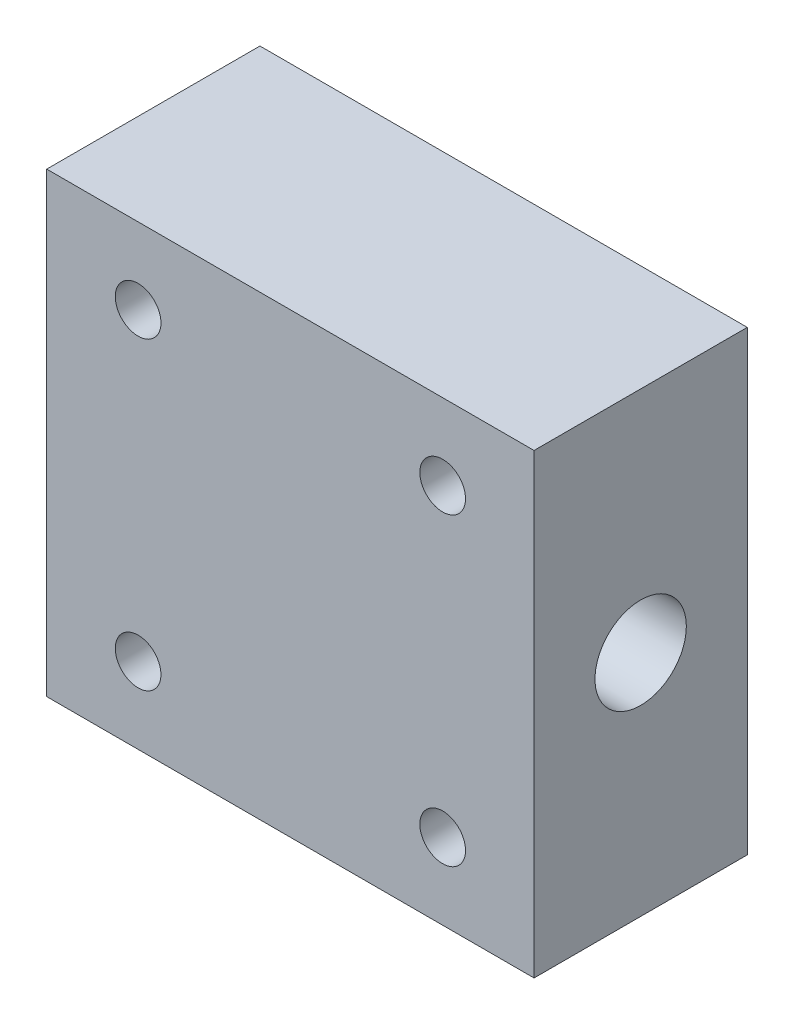
ISO-10303-21;
HEADER;
FILE_DESCRIPTION(('STEP AP214'),'2;1');
FILE_NAME('part.step','',(''),(''),'','','');
FILE_SCHEMA(('AUTOMOTIVE_DESIGN { 1 0 10303 214 1 1 1 1 }'));
ENDSEC;
DATA;
#1=APPLICATION_CONTEXT('core data for automotive mechanical design processes');
#2=APPLICATION_PROTOCOL_DEFINITION('international standard','automotive_design',2000,#1);
#3=PRODUCT_CONTEXT('',#1,'mechanical');
#4=PRODUCT('Part','Part','',(#3));
#5=PRODUCT_RELATED_PRODUCT_CATEGORY('part','',(#4));
#6=PRODUCT_DEFINITION_FORMATION('','',#4);
#7=PRODUCT_DEFINITION_CONTEXT('part definition',#1,'design');
#8=PRODUCT_DEFINITION('design','',#6,#7);
#9=PRODUCT_DEFINITION_SHAPE('','',#8);
#10=(LENGTH_UNIT() NAMED_UNIT(*) SI_UNIT(.MILLI.,.METRE.));
#11=(NAMED_UNIT(*) PLANE_ANGLE_UNIT() SI_UNIT($,.RADIAN.));
#12=(NAMED_UNIT(*) SI_UNIT($,.STERADIAN.) SOLID_ANGLE_UNIT());
#13=UNCERTAINTY_MEASURE_WITH_UNIT(LENGTH_MEASURE(1.E-05),#10,'distance_accuracy_value','');
#14=(GEOMETRIC_REPRESENTATION_CONTEXT(3) GLOBAL_UNCERTAINTY_ASSIGNED_CONTEXT((#13)) GLOBAL_UNIT_ASSIGNED_CONTEXT((#10,
#11,#12)) REPRESENTATION_CONTEXT('',''));
#15=CARTESIAN_POINT('',(0.,0.,0.));
#16=DIRECTION('',(0.,0.,1.));
#17=DIRECTION('',(1.,0.,0.));
#18=AXIS2_PLACEMENT_3D('',#15,#16,#17);
#19=CARTESIAN_POINT('',(16.,-15.,14.));
#20=DIRECTION('',(-1.,0.,0.));
#21=DIRECTION('',(0.,0.,1.));
#22=AXIS2_PLACEMENT_3D('',#19,#20,#21);
#23=PLANE('',#22);
#24=CARTESIAN_POINT('',(16.,0.,7.));
#25=DIRECTION('',(1.,0.,0.));
#26=DIRECTION('',(0.,0.,-1.));
#27=AXIS2_PLACEMENT_3D('',#24,#25,#26);
#28=CIRCLE('',#27,3.);
#29=CARTESIAN_POINT('',(16.,0.,4.));
#30=VERTEX_POINT('',#29);
#31=EDGE_CURVE('E123',#30,#30,#28,.T.);
#32=ORIENTED_EDGE('',*,*,#31,.F.);
#33=EDGE_LOOP('',(#32));
#34=FACE_BOUND('',#33,.T.);
#35=DIRECTION('',(0.,1.,0.));
#36=VECTOR('',#35,1.);
#37=CARTESIAN_POINT('',(16.,-15.,0.));
#38=LINE('',#37,#36);
#39=CARTESIAN_POINT('',(16.,-15.,0.));
#40=VERTEX_POINT('',#39);
#41=CARTESIAN_POINT('',(16.,15.,0.));
#42=VERTEX_POINT('',#41);
#43=EDGE_CURVE('E110',#40,#42,#38,.T.);
#44=ORIENTED_EDGE('',*,*,#43,.T.);
#45=DIRECTION('',(0.,0.,-1.));
#46=VECTOR('',#45,1.);
#47=CARTESIAN_POINT('',(16.,15.,14.));
#48=LINE('',#47,#46);
#49=CARTESIAN_POINT('',(16.,15.,14.));
#50=VERTEX_POINT('',#49);
#51=EDGE_CURVE('E11',#50,#42,#48,.T.);
#52=ORIENTED_EDGE('',*,*,#51,.F.);
#53=DIRECTION('',(0.,1.,0.));
#54=VECTOR('',#53,1.);
#55=CARTESIAN_POINT('',(16.,-15.,14.));
#56=LINE('',#55,#54);
#57=CARTESIAN_POINT('',(16.,-15.,14.));
#58=VERTEX_POINT('',#57);
#59=EDGE_CURVE('E97',#58,#50,#56,.T.);
#60=ORIENTED_EDGE('',*,*,#59,.F.);
#61=DIRECTION('',(0.,0.,-1.));
#62=VECTOR('',#61,1.);
#63=CARTESIAN_POINT('',(16.,-15.,14.));
#64=LINE('',#63,#62);
#65=EDGE_CURVE('E106',#58,#40,#64,.T.);
#66=ORIENTED_EDGE('',*,*,#65,.T.);
#67=EDGE_LOOP('',(#44,#52,#60,#66));
#68=FACE_BOUND('',#67,.T.);
#69=ADVANCED_FACE('F45',(#34,#68),#23,.F.);
#70=CARTESIAN_POINT('',(-16.,15.,14.));
#71=DIRECTION('',(0.,-1.,0.));
#72=DIRECTION('',(0.,0.,-1.));
#73=AXIS2_PLACEMENT_3D('',#70,#71,#72);
#74=PLANE('',#73);
#75=DIRECTION('',(-1.,0.,0.));
#76=VECTOR('',#75,1.);
#77=CARTESIAN_POINT('',(-16.,15.,0.));
#78=LINE('',#77,#76);
#79=CARTESIAN_POINT('',(-16.,15.,0.));
#80=VERTEX_POINT('',#79);
#81=EDGE_CURVE('E101',#42,#80,#78,.T.);
#82=ORIENTED_EDGE('',*,*,#81,.T.);
#83=DIRECTION('',(0.,0.,-1.));
#84=VECTOR('',#83,1.);
#85=CARTESIAN_POINT('',(-16.,15.,14.));
#86=LINE('',#85,#84);
#87=CARTESIAN_POINT('',(-16.,15.,14.));
#88=VERTEX_POINT('',#87);
#89=EDGE_CURVE('E54',#88,#80,#86,.T.);
#90=ORIENTED_EDGE('',*,*,#89,.F.);
#91=DIRECTION('',(-1.,0.,0.));
#92=VECTOR('',#91,1.);
#93=CARTESIAN_POINT('',(-16.,15.,14.));
#94=LINE('',#93,#92);
#95=EDGE_CURVE('E92',#50,#88,#94,.T.);
#96=ORIENTED_EDGE('',*,*,#95,.F.);
#97=ORIENTED_EDGE('',*,*,#51,.T.);
#98=EDGE_LOOP('',(#82,#90,#96,#97));
#99=FACE_BOUND('',#98,.T.);
#100=ADVANCED_FACE('F100',(#99),#74,.F.);
#101=CARTESIAN_POINT('',(-16.,-15.,14.));
#102=DIRECTION('',(1.,0.,0.));
#103=DIRECTION('',(0.,0.,-1.));
#104=AXIS2_PLACEMENT_3D('',#101,#102,#103);
#105=PLANE('',#104);
#106=CARTESIAN_POINT('',(-16.,0.,7.));
#107=DIRECTION('',(1.,0.,0.));
#108=DIRECTION('',(0.,0.,-1.));
#109=AXIS2_PLACEMENT_3D('',#106,#107,#108);
#110=CIRCLE('',#109,3.);
#111=CARTESIAN_POINT('',(-16.,0.,4.));
#112=VERTEX_POINT('',#111);
#113=EDGE_CURVE('E48',#112,#112,#110,.T.);
#114=ORIENTED_EDGE('',*,*,#113,.T.);
#115=EDGE_LOOP('',(#114));
#116=FACE_BOUND('',#115,.T.);
#117=DIRECTION('',(0.,-1.,0.));
#118=VECTOR('',#117,1.);
#119=CARTESIAN_POINT('',(-16.,-15.,0.));
#120=LINE('',#119,#118);
#121=CARTESIAN_POINT('',(-16.,-15.,0.));
#122=VERTEX_POINT('',#121);
#123=EDGE_CURVE('E79',#80,#122,#120,.T.);
#124=ORIENTED_EDGE('',*,*,#123,.T.);
#125=DIRECTION('',(0.,0.,-1.));
#126=VECTOR('',#125,1.);
#127=CARTESIAN_POINT('',(-16.,-15.,14.));
#128=LINE('',#127,#126);
#129=CARTESIAN_POINT('',(-16.,-15.,14.));
#130=VERTEX_POINT('',#129);
#131=EDGE_CURVE('E102',#130,#122,#128,.T.);
#132=ORIENTED_EDGE('',*,*,#131,.F.);
#133=DIRECTION('',(0.,-1.,0.));
#134=VECTOR('',#133,1.);
#135=CARTESIAN_POINT('',(-16.,-15.,14.));
#136=LINE('',#135,#134);
#137=EDGE_CURVE('E95',#88,#130,#136,.T.);
#138=ORIENTED_EDGE('',*,*,#137,.F.);
#139=ORIENTED_EDGE('',*,*,#89,.T.);
#140=EDGE_LOOP('',(#124,#132,#138,#139));
#141=FACE_BOUND('',#140,.T.);
#142=ADVANCED_FACE('F104',(#116,#141),#105,.F.);
#143=CARTESIAN_POINT('',(-16.,-15.,14.));
#144=DIRECTION('',(0.,1.,0.));
#145=DIRECTION('',(0.,0.,1.));
#146=AXIS2_PLACEMENT_3D('',#143,#144,#145);
#147=PLANE('',#146);
#148=DIRECTION('',(1.,0.,0.));
#149=VECTOR('',#148,1.);
#150=CARTESIAN_POINT('',(-16.,-15.,0.));
#151=LINE('',#150,#149);
#152=EDGE_CURVE('E85',#122,#40,#151,.T.);
#153=ORIENTED_EDGE('',*,*,#152,.T.);
#154=ORIENTED_EDGE('',*,*,#65,.F.);
#155=DIRECTION('',(1.,0.,0.));
#156=VECTOR('',#155,1.);
#157=CARTESIAN_POINT('',(-16.,-15.,14.));
#158=LINE('',#157,#156);
#159=EDGE_CURVE('E62',#130,#58,#158,.T.);
#160=ORIENTED_EDGE('',*,*,#159,.F.);
#161=ORIENTED_EDGE('',*,*,#131,.T.);
#162=EDGE_LOOP('',(#153,#154,#160,#161));
#163=FACE_BOUND('',#162,.T.);
#164=ADVANCED_FACE('F117',(#163),#147,.F.);
#165=CARTESIAN_POINT('',(0.,0.,14.));
#166=DIRECTION('',(0.,0.,-1.));
#167=DIRECTION('',(-1.,0.,0.));
#168=AXIS2_PLACEMENT_3D('',#165,#166,#167);
#169=PLANE('',#168);
#170=CARTESIAN_POINT('',(-10.,-10.,14.));
#171=DIRECTION('',(0.,0.,1.));
#172=DIRECTION('',(-1.,0.,0.));
#173=AXIS2_PLACEMENT_3D('',#170,#171,#172);
#174=CIRCLE('',#173,1.5);
#175=CARTESIAN_POINT('',(-11.5,-10.,14.));
#176=VERTEX_POINT('',#175);
#177=EDGE_CURVE('E133',#176,#176,#174,.T.);
#178=ORIENTED_EDGE('',*,*,#177,.F.);
#179=EDGE_LOOP('',(#178));
#180=FACE_BOUND('',#179,.T.);
#181=CARTESIAN_POINT('',(9.99999999999993,-10.,14.));
#182=DIRECTION('',(0.,0.,1.));
#183=DIRECTION('',(1.,0.,0.));
#184=AXIS2_PLACEMENT_3D('',#181,#182,#183);
#185=CIRCLE('',#184,1.50000000000001);
#186=CARTESIAN_POINT('',(11.4999999999999,-10.,14.));
#187=VERTEX_POINT('',#186);
#188=EDGE_CURVE('E139',#187,#187,#185,.T.);
#189=ORIENTED_EDGE('',*,*,#188,.F.);
#190=EDGE_LOOP('',(#189));
#191=FACE_BOUND('',#190,.T.);
#192=CARTESIAN_POINT('',(9.99999999999993,10.,14.));
#193=DIRECTION('',(0.,0.,1.));
#194=DIRECTION('',(-1.,0.,0.));
#195=AXIS2_PLACEMENT_3D('',#192,#193,#194);
#196=CIRCLE('',#195,1.50000000000001);
#197=CARTESIAN_POINT('',(8.49999999999992,10.,14.));
#198=VERTEX_POINT('',#197);
#199=EDGE_CURVE('E145',#198,#198,#196,.T.);
#200=ORIENTED_EDGE('',*,*,#199,.F.);
#201=EDGE_LOOP('',(#200));
#202=FACE_BOUND('',#201,.T.);
#203=CARTESIAN_POINT('',(-10.,10.,14.));
#204=DIRECTION('',(0.,0.,1.));
#205=DIRECTION('',(1.,0.,0.));
#206=AXIS2_PLACEMENT_3D('',#203,#204,#205);
#207=CIRCLE('',#206,1.5);
#208=CARTESIAN_POINT('',(-8.5,10.,14.));
#209=VERTEX_POINT('',#208);
#210=EDGE_CURVE('E127',#209,#209,#207,.T.);
#211=ORIENTED_EDGE('',*,*,#210,.F.);
#212=EDGE_LOOP('',(#211));
#213=FACE_BOUND('',#212,.T.);
#214=ORIENTED_EDGE('',*,*,#59,.T.);
#215=ORIENTED_EDGE('',*,*,#95,.T.);
#216=ORIENTED_EDGE('',*,*,#137,.T.);
#217=ORIENTED_EDGE('',*,*,#159,.T.);
#218=EDGE_LOOP('',(#214,#215,#216,#217));
#219=FACE_BOUND('',#218,.T.);
#220=ADVANCED_FACE('F93',(#180,#191,#202,#213,#219),#169,.F.);
#221=CARTESIAN_POINT('',(0.,0.,0.));
#222=DIRECTION('',(0.,0.,-1.));
#223=DIRECTION('',(-1.,0.,0.));
#224=AXIS2_PLACEMENT_3D('',#221,#222,#223);
#225=PLANE('',#224);
#226=ORIENTED_EDGE('',*,*,#43,.F.);
#227=ORIENTED_EDGE('',*,*,#152,.F.);
#228=ORIENTED_EDGE('',*,*,#123,.F.);
#229=ORIENTED_EDGE('',*,*,#81,.F.);
#230=EDGE_LOOP('',(#226,#227,#228,#229));
#231=FACE_BOUND('',#230,.T.);
#232=ADVANCED_FACE('F120',(#231),#225,.T.);
#233=CARTESIAN_POINT('',(-17.,0.,7.));
#234=DIRECTION('',(1.,0.,0.));
#235=DIRECTION('',(0.,0.,-1.));
#236=AXIS2_PLACEMENT_3D('',#233,#234,#235);
#237=CYLINDRICAL_SURFACE('',#236,3.);
#238=ORIENTED_EDGE('',*,*,#31,.T.);
#239=EDGE_LOOP('',(#238));
#240=FACE_BOUND('',#239,.T.);
#241=ORIENTED_EDGE('',*,*,#113,.F.);
#242=EDGE_LOOP('',(#241));
#243=FACE_BOUND('',#242,.T.);
#244=ADVANCED_FACE('F168',(#240,#243),#237,.F.);
#245=CARTESIAN_POINT('',(-10.,10.,11.));
#246=DIRECTION('',(0.,0.,1.));
#247=DIRECTION('',(1.,0.,0.));
#248=AXIS2_PLACEMENT_3D('',#245,#246,#247);
#249=CYLINDRICAL_SURFACE('',#248,1.5);
#250=CARTESIAN_POINT('',(-10.,10.,11.));
#251=DIRECTION('',(0.,0.,1.));
#252=DIRECTION('',(1.,0.,0.));
#253=AXIS2_PLACEMENT_3D('',#250,#251,#252);
#254=CIRCLE('',#253,1.5);
#255=CARTESIAN_POINT('',(-8.5,10.,11.));
#256=VERTEX_POINT('',#255);
#257=EDGE_CURVE('E126',#256,#256,#254,.T.);
#258=ORIENTED_EDGE('',*,*,#257,.F.);
#259=EDGE_LOOP('',(#258));
#260=FACE_BOUND('',#259,.T.);
#261=ORIENTED_EDGE('',*,*,#210,.T.);
#262=EDGE_LOOP('',(#261));
#263=FACE_BOUND('',#262,.T.);
#264=ADVANCED_FACE('F166',(#260,#263),#249,.F.);
#265=CARTESIAN_POINT('',(-10.,10.,11.));
#266=DIRECTION('',(0.,0.,1.));
#267=DIRECTION('',(1.,0.,0.));
#268=AXIS2_PLACEMENT_3D('',#265,#266,#267);
#269=PLANE('',#268);
#270=ORIENTED_EDGE('',*,*,#257,.T.);
#271=EDGE_LOOP('',(#270));
#272=FACE_BOUND('',#271,.T.);
#273=ADVANCED_FACE('F156',(#272),#269,.T.);
#274=CARTESIAN_POINT('',(9.99999999999993,10.,11.));
#275=DIRECTION('',(0.,0.,1.));
#276=DIRECTION('',(1.,0.,0.));
#277=AXIS2_PLACEMENT_3D('',#274,#275,#276);
#278=CYLINDRICAL_SURFACE('',#277,1.50000000000001);
#279=CARTESIAN_POINT('',(9.99999999999993,10.,11.));
#280=DIRECTION('',(0.,0.,1.));
#281=DIRECTION('',(-1.,0.,0.));
#282=AXIS2_PLACEMENT_3D('',#279,#280,#281);
#283=CIRCLE('',#282,1.50000000000001);
#284=CARTESIAN_POINT('',(8.49999999999992,10.,11.));
#285=VERTEX_POINT('',#284);
#286=EDGE_CURVE('E130',#285,#285,#283,.T.);
#287=ORIENTED_EDGE('',*,*,#286,.F.);
#288=EDGE_LOOP('',(#287));
#289=FACE_BOUND('',#288,.T.);
#290=ORIENTED_EDGE('',*,*,#199,.T.);
#291=EDGE_LOOP('',(#290));
#292=FACE_BOUND('',#291,.T.);
#293=ADVANCED_FACE('F153',(#289,#292),#278,.F.);
#294=CARTESIAN_POINT('',(9.99999999999993,10.,11.));
#295=DIRECTION('',(0.,0.,-1.));
#296=DIRECTION('',(-1.,0.,0.));
#297=AXIS2_PLACEMENT_3D('',#294,#295,#296);
#298=PLANE('',#297);
#299=ORIENTED_EDGE('',*,*,#286,.T.);
#300=EDGE_LOOP('',(#299));
#301=FACE_BOUND('',#300,.T.);
#302=ADVANCED_FACE('F151',(#301),#298,.F.);
#303=CARTESIAN_POINT('',(9.99999999999993,-10.,11.));
#304=DIRECTION('',(0.,0.,1.));
#305=DIRECTION('',(1.,0.,0.));
#306=AXIS2_PLACEMENT_3D('',#303,#304,#305);
#307=CYLINDRICAL_SURFACE('',#306,1.50000000000001);
#308=CARTESIAN_POINT('',(9.99999999999993,-10.,11.));
#309=DIRECTION('',(0.,0.,1.));
#310=DIRECTION('',(1.,0.,0.));
#311=AXIS2_PLACEMENT_3D('',#308,#309,#310);
#312=CIRCLE('',#311,1.50000000000001);
#313=CARTESIAN_POINT('',(11.4999999999999,-10.,11.));
#314=VERTEX_POINT('',#313);
#315=EDGE_CURVE('E142',#314,#314,#312,.T.);
#316=ORIENTED_EDGE('',*,*,#315,.F.);
#317=EDGE_LOOP('',(#316));
#318=FACE_BOUND('',#317,.T.);
#319=ORIENTED_EDGE('',*,*,#188,.T.);
#320=EDGE_LOOP('',(#319));
#321=FACE_BOUND('',#320,.T.);
#322=ADVANCED_FACE('F237',(#318,#321),#307,.F.);
#323=CARTESIAN_POINT('',(9.99999999999993,-10.,11.));
#324=DIRECTION('',(0.,0.,1.));
#325=DIRECTION('',(1.,0.,0.));
#326=AXIS2_PLACEMENT_3D('',#323,#324,#325);
#327=PLANE('',#326);
#328=ORIENTED_EDGE('',*,*,#315,.T.);
#329=EDGE_LOOP('',(#328));
#330=FACE_BOUND('',#329,.T.);
#331=ADVANCED_FACE('F244',(#330),#327,.T.);
#332=CARTESIAN_POINT('',(-10.,-10.,11.));
#333=DIRECTION('',(0.,0.,1.));
#334=DIRECTION('',(1.,0.,0.));
#335=AXIS2_PLACEMENT_3D('',#332,#333,#334);
#336=CYLINDRICAL_SURFACE('',#335,1.5);
#337=CARTESIAN_POINT('',(-10.,-10.,11.));
#338=DIRECTION('',(0.,0.,1.));
#339=DIRECTION('',(-1.,0.,0.));
#340=AXIS2_PLACEMENT_3D('',#337,#338,#339);
#341=CIRCLE('',#340,1.5);
#342=CARTESIAN_POINT('',(-11.5,-10.,11.));
#343=VERTEX_POINT('',#342);
#344=EDGE_CURVE('E136',#343,#343,#341,.T.);
#345=ORIENTED_EDGE('',*,*,#344,.F.);
#346=EDGE_LOOP('',(#345));
#347=FACE_BOUND('',#346,.T.);
#348=ORIENTED_EDGE('',*,*,#177,.T.);
#349=EDGE_LOOP('',(#348));
#350=FACE_BOUND('',#349,.T.);
#351=ADVANCED_FACE('F252',(#347,#350),#336,.F.);
#352=CARTESIAN_POINT('',(-10.,-10.,11.));
#353=DIRECTION('',(0.,0.,-1.));
#354=DIRECTION('',(-1.,0.,0.));
#355=AXIS2_PLACEMENT_3D('',#352,#353,#354);
#356=PLANE('',#355);
#357=ORIENTED_EDGE('',*,*,#344,.T.);
#358=EDGE_LOOP('',(#357));
#359=FACE_BOUND('',#358,.T.);
#360=ADVANCED_FACE('F260',(#359),#356,.F.);
#361=CLOSED_SHELL('',(#69,#100,#142,#164,#220,#232,#244,#264,#273,#293,#302,#322,#331,#351,#360));
#362=MANIFOLD_SOLID_BREP('B2',#361);
#363=ADVANCED_BREP_SHAPE_REPRESENTATION('',(#18,#362),#14);
#364=SHAPE_DEFINITION_REPRESENTATION(#9,#363);
ENDSEC;
END-ISO-10303-21;
